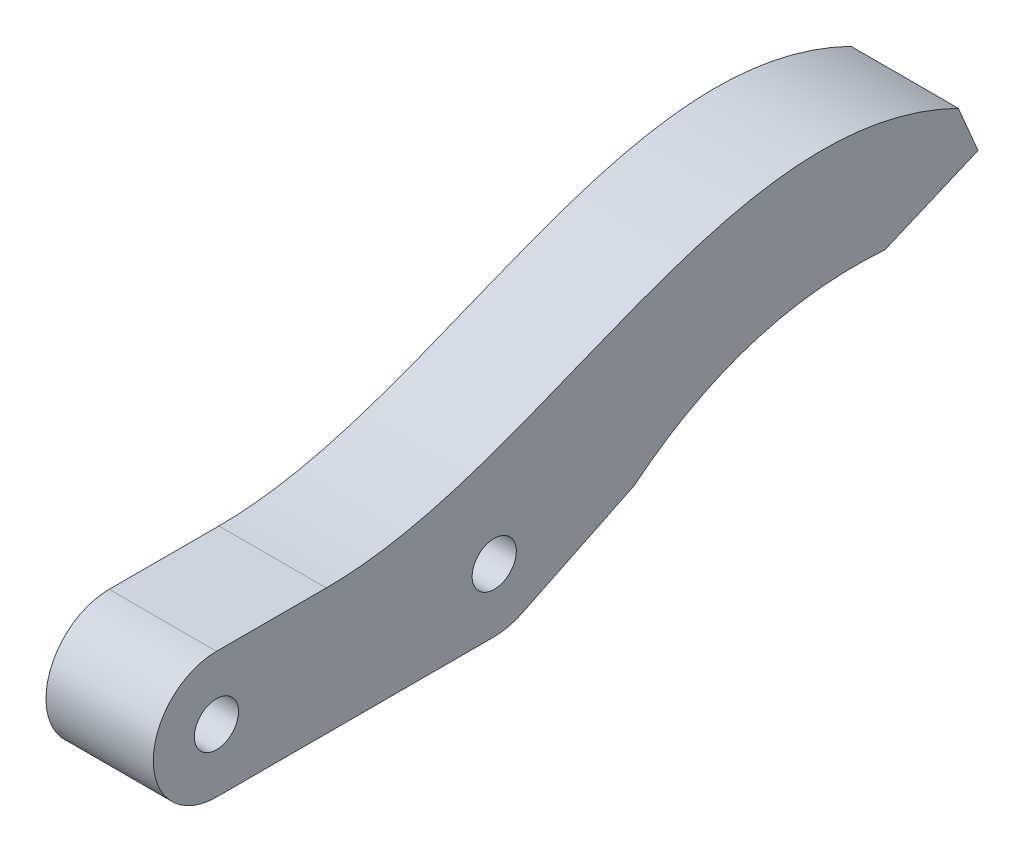
ISO-10303-21;
HEADER;
FILE_DESCRIPTION(('STEP AP214'),'2;1');
FILE_NAME('part.step','',(''),(''),'','','');
FILE_SCHEMA(('AUTOMOTIVE_DESIGN { 1 0 10303 214 1 1 1 1 }'));
ENDSEC;
DATA;
#1=APPLICATION_CONTEXT('core data for automotive mechanical design processes');
#2=APPLICATION_PROTOCOL_DEFINITION('international standard','automotive_design',2000,#1);
#3=PRODUCT_CONTEXT('',#1,'mechanical');
#4=PRODUCT('Part','Part','',(#3));
#5=PRODUCT_RELATED_PRODUCT_CATEGORY('part','',(#4));
#6=PRODUCT_DEFINITION_FORMATION('','',#4);
#7=PRODUCT_DEFINITION_CONTEXT('part definition',#1,'design');
#8=PRODUCT_DEFINITION('design','',#6,#7);
#9=PRODUCT_DEFINITION_SHAPE('','',#8);
#10=(LENGTH_UNIT() NAMED_UNIT(*) SI_UNIT(.MILLI.,.METRE.));
#11=(NAMED_UNIT(*) PLANE_ANGLE_UNIT() SI_UNIT($,.RADIAN.));
#12=(NAMED_UNIT(*) SI_UNIT($,.STERADIAN.) SOLID_ANGLE_UNIT());
#13=UNCERTAINTY_MEASURE_WITH_UNIT(LENGTH_MEASURE(1.E-05),#10,'distance_accuracy_value','');
#14=(GEOMETRIC_REPRESENTATION_CONTEXT(3) GLOBAL_UNCERTAINTY_ASSIGNED_CONTEXT((#13)) GLOBAL_UNIT_ASSIGNED_CONTEXT((#10,
#11,#12)) REPRESENTATION_CONTEXT('',''));
#15=CARTESIAN_POINT('',(0.,0.,0.));
#16=DIRECTION('',(0.,0.,1.));
#17=DIRECTION('',(1.,0.,0.));
#18=AXIS2_PLACEMENT_3D('',#15,#16,#17);
#19=CARTESIAN_POINT('',(8.5,5.,-27.));
#20=DIRECTION('',(-1.,0.,0.));
#21=DIRECTION('',(0.,0.,1.));
#22=AXIS2_PLACEMENT_3D('',#19,#20,#21);
#23=CYLINDRICAL_SURFACE('',#22,5.);
#24=DIRECTION('',(1.,0.,0.));
#25=VECTOR('',#24,1.);
#26=CARTESIAN_POINT('',(0.,0.502127655445501,-29.1838370754458));
#27=LINE('',#26,#25);
#28=CARTESIAN_POINT('',(0.,0.502127655445501,-29.1838370754458));
#29=VERTEX_POINT('',#28);
#30=CARTESIAN_POINT('',(8.5,0.502127655445501,-29.1838370754458));
#31=VERTEX_POINT('',#30);
#32=EDGE_CURVE('E191',#29,#31,#27,.T.);
#33=ORIENTED_EDGE('',*,*,#32,.T.);
#34=CARTESIAN_POINT('',(8.5,5.,-27.));
#35=DIRECTION('',(1.,0.,0.));
#36=DIRECTION('',(0.,0.,-1.));
#37=AXIS2_PLACEMENT_3D('',#34,#35,#36);
#38=CIRCLE('',#37,5.);
#39=CARTESIAN_POINT('',(8.5,0.,-27.));
#40=VERTEX_POINT('',#39);
#41=EDGE_CURVE('E203',#40,#31,#38,.T.);
#42=ORIENTED_EDGE('',*,*,#41,.F.);
#43=DIRECTION('',(-1.,0.,0.));
#44=VECTOR('',#43,1.);
#45=CARTESIAN_POINT('',(8.5,0.,-27.));
#46=LINE('',#45,#44);
#47=CARTESIAN_POINT('',(0.,0.,-27.));
#48=VERTEX_POINT('',#47);
#49=EDGE_CURVE('E211',#40,#48,#46,.T.);
#50=ORIENTED_EDGE('',*,*,#49,.T.);
#51=CARTESIAN_POINT('',(0.,5.,-27.));
#52=DIRECTION('',(1.,0.,0.));
#53=DIRECTION('',(0.,0.,-1.));
#54=AXIS2_PLACEMENT_3D('',#51,#52,#53);
#55=CIRCLE('',#54,5.);
#56=EDGE_CURVE('E215',#48,#29,#55,.T.);
#57=ORIENTED_EDGE('',*,*,#56,.T.);
#58=EDGE_LOOP('',(#33,#42,#50,#57));
#59=FACE_BOUND('',#58,.T.);
#60=ADVANCED_FACE('F36',(#59),#23,.T.);
#61=CARTESIAN_POINT('',(8.5,10.,0.));
#62=DIRECTION('',(0.,1.,0.));
#63=DIRECTION('',(0.,0.,1.));
#64=AXIS2_PLACEMENT_3D('',#61,#62,#63);
#65=PLANE('',#64);
#66=DIRECTION('',(1.,0.,0.));
#67=VECTOR('',#66,1.);
#68=CARTESIAN_POINT('',(0.,10.,-13.6949747586838));
#69=LINE('',#68,#67);
#70=CARTESIAN_POINT('',(0.,10.,-13.6949747586838));
#71=VERTEX_POINT('',#70);
#72=CARTESIAN_POINT('',(8.5,10.,-13.6949747586838));
#73=VERTEX_POINT('',#72);
#74=EDGE_CURVE('E126',#71,#73,#69,.T.);
#75=ORIENTED_EDGE('',*,*,#74,.F.);
#76=DIRECTION('',(0.,0.,-1.));
#77=VECTOR('',#76,1.);
#78=CARTESIAN_POINT('',(0.,10.,0.));
#79=LINE('',#78,#77);
#80=CARTESIAN_POINT('',(0.,10.,-5.));
#81=VERTEX_POINT('',#80);
#82=EDGE_CURVE('E137',#81,#71,#79,.T.);
#83=ORIENTED_EDGE('',*,*,#82,.F.);
#84=DIRECTION('',(-1.,0.,0.));
#85=VECTOR('',#84,1.);
#86=CARTESIAN_POINT('',(8.5,10.,-5.));
#87=LINE('',#86,#85);
#88=CARTESIAN_POINT('',(8.5,10.,-5.));
#89=VERTEX_POINT('',#88);
#90=EDGE_CURVE('E11',#89,#81,#87,.T.);
#91=ORIENTED_EDGE('',*,*,#90,.F.);
#92=DIRECTION('',(0.,0.,-1.));
#93=VECTOR('',#92,1.);
#94=CARTESIAN_POINT('',(8.5,10.,0.));
#95=LINE('',#94,#93);
#96=EDGE_CURVE('E190',#89,#73,#95,.T.);
#97=ORIENTED_EDGE('',*,*,#96,.T.);
#98=EDGE_LOOP('',(#75,#83,#91,#97));
#99=FACE_BOUND('',#98,.T.);
#100=ADVANCED_FACE('F38',(#99),#65,.T.);
#101=CARTESIAN_POINT('',(8.5,5.,-5.));
#102=DIRECTION('',(-1.,0.,0.));
#103=DIRECTION('',(0.,0.,1.));
#104=AXIS2_PLACEMENT_3D('',#101,#102,#103);
#105=CYLINDRICAL_SURFACE('',#104,5.);
#106=CARTESIAN_POINT('',(0.,5.,-5.));
#107=DIRECTION('',(1.,0.,0.));
#108=DIRECTION('',(0.,0.,-1.));
#109=AXIS2_PLACEMENT_3D('',#106,#107,#108);
#110=CIRCLE('',#109,5.);
#111=CARTESIAN_POINT('',(0.,0.,-5.));
#112=VERTEX_POINT('',#111);
#113=EDGE_CURVE('E66',#81,#112,#110,.T.);
#114=ORIENTED_EDGE('',*,*,#113,.T.);
#115=DIRECTION('',(-1.,0.,0.));
#116=VECTOR('',#115,1.);
#117=CARTESIAN_POINT('',(8.5,0.,-5.));
#118=LINE('',#117,#116);
#119=CARTESIAN_POINT('',(8.5,0.,-5.));
#120=VERTEX_POINT('',#119);
#121=EDGE_CURVE('E45',#120,#112,#118,.T.);
#122=ORIENTED_EDGE('',*,*,#121,.F.);
#123=CARTESIAN_POINT('',(8.5,5.,-5.));
#124=DIRECTION('',(1.,0.,0.));
#125=DIRECTION('',(0.,0.,-1.));
#126=AXIS2_PLACEMENT_3D('',#123,#124,#125);
#127=CIRCLE('',#126,5.);
#128=EDGE_CURVE('E199',#89,#120,#127,.T.);
#129=ORIENTED_EDGE('',*,*,#128,.F.);
#130=ORIENTED_EDGE('',*,*,#90,.T.);
#131=EDGE_LOOP('',(#114,#122,#129,#130));
#132=FACE_BOUND('',#131,.T.);
#133=ADVANCED_FACE('F182',(#132),#105,.T.);
#134=CARTESIAN_POINT('',(8.5,0.,0.));
#135=DIRECTION('',(0.,1.,0.));
#136=DIRECTION('',(0.,0.,1.));
#137=AXIS2_PLACEMENT_3D('',#134,#135,#136);
#138=PLANE('',#137);
#139=DIRECTION('',(0.,0.,-1.));
#140=VECTOR('',#139,1.);
#141=CARTESIAN_POINT('',(0.,0.,0.));
#142=LINE('',#141,#140);
#143=EDGE_CURVE('E71',#112,#48,#142,.T.);
#144=ORIENTED_EDGE('',*,*,#143,.T.);
#145=ORIENTED_EDGE('',*,*,#49,.F.);
#146=DIRECTION('',(0.,0.,-1.));
#147=VECTOR('',#146,1.);
#148=CARTESIAN_POINT('',(8.5,0.,0.));
#149=LINE('',#148,#147);
#150=EDGE_CURVE('E53',#120,#40,#149,.T.);
#151=ORIENTED_EDGE('',*,*,#150,.F.);
#152=ORIENTED_EDGE('',*,*,#121,.T.);
#153=EDGE_LOOP('',(#144,#145,#151,#152));
#154=FACE_BOUND('',#153,.T.);
#155=ADVANCED_FACE('F176',(#154),#138,.F.);
#156=CARTESIAN_POINT('',(8.5,5.,-5.));
#157=DIRECTION('',(-1.,0.,0.));
#158=DIRECTION('',(0.,0.,1.));
#159=AXIS2_PLACEMENT_3D('',#156,#157,#158);
#160=CYLINDRICAL_SURFACE('',#159,1.75);
#161=CARTESIAN_POINT('',(8.5,5.,-5.));
#162=DIRECTION('',(1.,0.,0.));
#163=DIRECTION('',(0.,0.,-1.));
#164=AXIS2_PLACEMENT_3D('',#161,#162,#163);
#165=CIRCLE('',#164,1.75);
#166=CARTESIAN_POINT('',(8.5,5.,-6.75));
#167=VERTEX_POINT('',#166);
#168=EDGE_CURVE('E205',#167,#167,#165,.T.);
#169=ORIENTED_EDGE('',*,*,#168,.T.);
#170=EDGE_LOOP('',(#169));
#171=FACE_BOUND('',#170,.T.);
#172=CARTESIAN_POINT('',(0.,5.,-5.));
#173=DIRECTION('',(1.,0.,0.));
#174=DIRECTION('',(0.,0.,-1.));
#175=AXIS2_PLACEMENT_3D('',#172,#173,#174);
#176=CIRCLE('',#175,1.75);
#177=CARTESIAN_POINT('',(0.,5.,-6.75));
#178=VERTEX_POINT('',#177);
#179=EDGE_CURVE('E218',#178,#178,#176,.T.);
#180=ORIENTED_EDGE('',*,*,#179,.F.);
#181=EDGE_LOOP('',(#180));
#182=FACE_BOUND('',#181,.T.);
#183=ADVANCED_FACE('F172',(#171,#182),#160,.F.);
#184=CARTESIAN_POINT('',(8.5,5.,-27.));
#185=DIRECTION('',(-1.,0.,0.));
#186=DIRECTION('',(0.,0.,1.));
#187=AXIS2_PLACEMENT_3D('',#184,#185,#186);
#188=CYLINDRICAL_SURFACE('',#187,1.75);
#189=CARTESIAN_POINT('',(8.5,5.,-27.));
#190=DIRECTION('',(1.,0.,0.));
#191=DIRECTION('',(0.,0.,-1.));
#192=AXIS2_PLACEMENT_3D('',#189,#190,#191);
#193=CIRCLE('',#192,1.75);
#194=CARTESIAN_POINT('',(8.5,5.,-28.75));
#195=VERTEX_POINT('',#194);
#196=EDGE_CURVE('E208',#195,#195,#193,.T.);
#197=ORIENTED_EDGE('',*,*,#196,.T.);
#198=EDGE_LOOP('',(#197));
#199=FACE_BOUND('',#198,.T.);
#200=CARTESIAN_POINT('',(0.,5.,-27.));
#201=DIRECTION('',(1.,0.,0.));
#202=DIRECTION('',(0.,0.,-1.));
#203=AXIS2_PLACEMENT_3D('',#200,#201,#202);
#204=CIRCLE('',#203,1.75);
#205=CARTESIAN_POINT('',(0.,5.,-28.75));
#206=VERTEX_POINT('',#205);
#207=EDGE_CURVE('E200',#206,#206,#204,.T.);
#208=ORIENTED_EDGE('',*,*,#207,.F.);
#209=EDGE_LOOP('',(#208));
#210=FACE_BOUND('',#209,.T.);
#211=ADVANCED_FACE('F167',(#199,#210),#188,.F.);
#212=CARTESIAN_POINT('',(8.5,0.,0.));
#213=DIRECTION('',(1.,0.,0.));
#214=DIRECTION('',(0.,0.,-1.));
#215=AXIS2_PLACEMENT_3D('',#212,#213,#214);
#216=PLANE('',#215);
#217=ORIENTED_EDGE('',*,*,#96,.F.);
#218=ORIENTED_EDGE('',*,*,#128,.T.);
#219=ORIENTED_EDGE('',*,*,#150,.T.);
#220=ORIENTED_EDGE('',*,*,#41,.T.);
#221=DIRECTION('',(0.,0.436767415089167,-0.8995744689109));
#222=VECTOR('',#221,1.);
#223=CARTESIAN_POINT('',(8.5,-11.0601312365663,-5.36998891997289));
#224=LINE('',#223,#222);
#225=CARTESIAN_POINT('',(8.5,4.82408407678908,-38.0854206599091));
#226=VERTEX_POINT('',#225);
#227=EDGE_CURVE('E231',#31,#226,#224,.T.);
#228=ORIENTED_EDGE('',*,*,#227,.T.);
#229=CARTESIAN_POINT('',(8.5,4.82408407678908,-38.0854206599091));
#230=CARTESIAN_POINT('',(8.5,11.8952224566425,-46.7975095094647));
#231=CARTESIAN_POINT('',(8.5,11.0678436667493,-57.9480004086976));
#232=B_SPLINE_CURVE_WITH_KNOTS('',2,(#229,#230,#231),.UNSPECIFIED.,.F.,.F.,(3,3),(0.,1.),.UNSPECIFIED.);
#233=CARTESIAN_POINT('',(8.5,11.0678436667493,-57.9480004086976));
#234=VERTEX_POINT('',#233);
#235=EDGE_CURVE('E145',#226,#234,#232,.T.);
#236=ORIENTED_EDGE('',*,*,#235,.T.);
#237=DIRECTION('',(0.,0.39020935118337,-0.920726160293631));
#238=VECTOR('',#237,1.);
#239=CARTESIAN_POINT('',(8.5,-11.4367064909869,-4.84694582599828));
#240=LINE('',#239,#238);
#241=CARTESIAN_POINT('',(8.5,14.1895184762162,-65.3138096910467));
#242=VERTEX_POINT('',#241);
#243=EDGE_CURVE('E142',#234,#242,#240,.T.);
#244=ORIENTED_EDGE('',*,*,#243,.T.);
#245=DIRECTION('',(0.,0.920726160293631,0.39020935118337));
#246=VECTOR('',#245,1.);
#247=CARTESIAN_POINT('',(8.5,25.6262249672031,-60.4668638650484));
#248=LINE('',#247,#246);
#249=CARTESIAN_POINT('',(8.5,17.8724231173908,-63.7529722863132));
#250=VERTEX_POINT('',#249);
#251=EDGE_CURVE('E237',#242,#250,#248,.T.);
#252=ORIENTED_EDGE('',*,*,#251,.T.);
#253=CARTESIAN_POINT('',(8.5,17.8724231173908,-63.7529722863132));
#254=CARTESIAN_POINT('',(8.5,26.563787962677,-45.9288826779558));
#255=CARTESIAN_POINT('',(8.5,10.,-31.059268620705));
#256=CARTESIAN_POINT('',(8.5,10.,-13.6949747586838));
#257=B_SPLINE_CURVE_WITH_KNOTS('',3,(#253,#254,#255,#256),.UNSPECIFIED.,.F.,.F.,(4,4),(0.,1.),.UNSPECIFIED.);
#258=EDGE_CURVE('E121',#250,#73,#257,.T.);
#259=ORIENTED_EDGE('',*,*,#258,.T.);
#260=EDGE_LOOP('',(#217,#218,#219,#220,#228,#236,#244,#252,#259));
#261=FACE_BOUND('',#260,.T.);
#262=ORIENTED_EDGE('',*,*,#168,.F.);
#263=EDGE_LOOP('',(#262));
#264=FACE_BOUND('',#263,.T.);
#265=ORIENTED_EDGE('',*,*,#196,.F.);
#266=EDGE_LOOP('',(#265));
#267=FACE_BOUND('',#266,.T.);
#268=ADVANCED_FACE('F164',(#261,#264,#267),#216,.T.);
#269=CARTESIAN_POINT('',(0.,0.,0.));
#270=DIRECTION('',(1.,0.,0.));
#271=DIRECTION('',(0.,0.,-1.));
#272=AXIS2_PLACEMENT_3D('',#269,#270,#271);
#273=PLANE('',#272);
#274=ORIENTED_EDGE('',*,*,#82,.T.);
#275=CARTESIAN_POINT('',(0.,17.8724231173908,-63.7529722863132));
#276=CARTESIAN_POINT('',(0.,26.563787962677,-45.9288826779558));
#277=CARTESIAN_POINT('',(0.,10.,-31.059268620705));
#278=CARTESIAN_POINT('',(0.,10.,-13.6949747586838));
#279=B_SPLINE_CURVE_WITH_KNOTS('',3,(#275,#276,#277,#278),.UNSPECIFIED.,.F.,.F.,(4,4),(0.,1.),.UNSPECIFIED.);
#280=CARTESIAN_POINT('',(0.,17.8724231173908,-63.7529722863132));
#281=VERTEX_POINT('',#280);
#282=EDGE_CURVE('E118',#281,#71,#279,.T.);
#283=ORIENTED_EDGE('',*,*,#282,.F.);
#284=DIRECTION('',(0.,0.920726160293631,0.39020935118337));
#285=VECTOR('',#284,1.);
#286=CARTESIAN_POINT('',(0.,25.6262249672031,-60.4668638650484));
#287=LINE('',#286,#285);
#288=CARTESIAN_POINT('',(0.,14.1895184762162,-65.3138096910467));
#289=VERTEX_POINT('',#288);
#290=EDGE_CURVE('E135',#289,#281,#287,.T.);
#291=ORIENTED_EDGE('',*,*,#290,.F.);
#292=DIRECTION('',(0.,0.39020935118337,-0.920726160293631));
#293=VECTOR('',#292,1.);
#294=CARTESIAN_POINT('',(0.,-11.4367064909869,-4.84694582599828));
#295=LINE('',#294,#293);
#296=CARTESIAN_POINT('',(0.,11.0678436667493,-57.9480004086976));
#297=VERTEX_POINT('',#296);
#298=EDGE_CURVE('E127',#297,#289,#295,.T.);
#299=ORIENTED_EDGE('',*,*,#298,.F.);
#300=CARTESIAN_POINT('',(0.,4.82408407678908,-38.0854206599091));
#301=CARTESIAN_POINT('',(0.,11.8952224566425,-46.7975095094647));
#302=CARTESIAN_POINT('',(0.,11.0678436667493,-57.9480004086976));
#303=B_SPLINE_CURVE_WITH_KNOTS('',2,(#300,#301,#302),.UNSPECIFIED.,.F.,.F.,(3,3),(0.,1.),.UNSPECIFIED.);
#304=CARTESIAN_POINT('',(0.,4.82408407678908,-38.0854206599091));
#305=VERTEX_POINT('',#304);
#306=EDGE_CURVE('E253',#305,#297,#303,.T.);
#307=ORIENTED_EDGE('',*,*,#306,.F.);
#308=DIRECTION('',(0.,0.436767415089167,-0.8995744689109));
#309=VECTOR('',#308,1.);
#310=CARTESIAN_POINT('',(0.,-11.0601312365663,-5.36998891997289));
#311=LINE('',#310,#309);
#312=EDGE_CURVE('E138',#29,#305,#311,.T.);
#313=ORIENTED_EDGE('',*,*,#312,.F.);
#314=ORIENTED_EDGE('',*,*,#56,.F.);
#315=ORIENTED_EDGE('',*,*,#143,.F.);
#316=ORIENTED_EDGE('',*,*,#113,.F.);
#317=EDGE_LOOP('',(#274,#283,#291,#299,#307,#313,#314,#315,#316));
#318=FACE_BOUND('',#317,.T.);
#319=ORIENTED_EDGE('',*,*,#179,.T.);
#320=EDGE_LOOP('',(#319));
#321=FACE_BOUND('',#320,.T.);
#322=ORIENTED_EDGE('',*,*,#207,.T.);
#323=EDGE_LOOP('',(#322));
#324=FACE_BOUND('',#323,.T.);
#325=ADVANCED_FACE('F132',(#318,#321,#324),#273,.F.);
#326=CARTESIAN_POINT('',(0.,25.6262249672031,-60.4668638650484));
#327=DIRECTION('',(0.,0.39020935118337,-0.920726160293631));
#328=DIRECTION('',(0.,0.920726160293631,0.39020935118337));
#329=AXIS2_PLACEMENT_3D('',#326,#327,#328);
#330=PLANE('',#329);
#331=ORIENTED_EDGE('',*,*,#251,.F.);
#332=DIRECTION('',(1.,0.,0.));
#333=VECTOR('',#332,1.);
#334=CARTESIAN_POINT('',(0.,14.1895184762162,-65.3138096910467));
#335=LINE('',#334,#333);
#336=EDGE_CURVE('E141',#289,#242,#335,.T.);
#337=ORIENTED_EDGE('',*,*,#336,.F.);
#338=ORIENTED_EDGE('',*,*,#290,.T.);
#339=DIRECTION('',(1.,0.,0.));
#340=VECTOR('',#339,1.);
#341=CARTESIAN_POINT('',(0.,17.8724231173908,-63.7529722863132));
#342=LINE('',#341,#340);
#343=EDGE_CURVE('E115',#281,#250,#342,.T.);
#344=ORIENTED_EDGE('',*,*,#343,.T.);
#345=EDGE_LOOP('',(#331,#337,#338,#344));
#346=FACE_BOUND('',#345,.T.);
#347=ADVANCED_FACE('F140',(#346),#330,.T.);
#348=CARTESIAN_POINT('',(0.,-11.4367064909869,-4.84694582599828));
#349=DIRECTION('',(0.,-0.920726160293631,-0.39020935118337));
#350=DIRECTION('',(0.,0.39020935118337,-0.920726160293631));
#351=AXIS2_PLACEMENT_3D('',#348,#349,#350);
#352=PLANE('',#351);
#353=ORIENTED_EDGE('',*,*,#243,.F.);
#354=DIRECTION('',(1.,0.,0.));
#355=VECTOR('',#354,1.);
#356=CARTESIAN_POINT('',(0.,11.0678436667493,-57.9480004086976));
#357=LINE('',#356,#355);
#358=EDGE_CURVE('E249',#297,#234,#357,.T.);
#359=ORIENTED_EDGE('',*,*,#358,.F.);
#360=ORIENTED_EDGE('',*,*,#298,.T.);
#361=ORIENTED_EDGE('',*,*,#336,.T.);
#362=EDGE_LOOP('',(#353,#359,#360,#361));
#363=FACE_BOUND('',#362,.T.);
#364=ADVANCED_FACE('F163',(#363),#352,.T.);
#365=DIRECTION('',(1.,0.,0.));
#366=VECTOR('',#365,1.);
#367=SURFACE_OF_LINEAR_EXTRUSION('',#303,#366);
#368=ORIENTED_EDGE('',*,*,#235,.F.);
#369=DIRECTION('',(1.,0.,0.));
#370=VECTOR('',#369,1.);
#371=CARTESIAN_POINT('',(0.,4.82408407678908,-38.0854206599091));
#372=LINE('',#371,#370);
#373=EDGE_CURVE('E194',#305,#226,#372,.T.);
#374=ORIENTED_EDGE('',*,*,#373,.F.);
#375=ORIENTED_EDGE('',*,*,#306,.T.);
#376=ORIENTED_EDGE('',*,*,#358,.T.);
#377=EDGE_LOOP('',(#368,#374,#375,#376));
#378=FACE_BOUND('',#377,.T.);
#379=ADVANCED_FACE('F252',(#378),#367,.T.);
#380=CARTESIAN_POINT('',(0.,-11.0601312365663,-5.36998891997289));
#381=DIRECTION('',(0.,-0.8995744689109,-0.436767415089167));
#382=DIRECTION('',(0.,0.436767415089167,-0.8995744689109));
#383=AXIS2_PLACEMENT_3D('',#380,#381,#382);
#384=PLANE('',#383);
#385=ORIENTED_EDGE('',*,*,#227,.F.);
#386=ORIENTED_EDGE('',*,*,#32,.F.);
#387=ORIENTED_EDGE('',*,*,#312,.T.);
#388=ORIENTED_EDGE('',*,*,#373,.T.);
#389=EDGE_LOOP('',(#385,#386,#387,#388));
#390=FACE_BOUND('',#389,.T.);
#391=ADVANCED_FACE('F159',(#390),#384,.T.);
#392=DIRECTION('',(1.,0.,0.));
#393=VECTOR('',#392,1.);
#394=SURFACE_OF_LINEAR_EXTRUSION('',#279,#393);
#395=ORIENTED_EDGE('',*,*,#258,.F.);
#396=ORIENTED_EDGE('',*,*,#343,.F.);
#397=ORIENTED_EDGE('',*,*,#282,.T.);
#398=ORIENTED_EDGE('',*,*,#74,.T.);
#399=EDGE_LOOP('',(#395,#396,#397,#398));
#400=FACE_BOUND('',#399,.T.);
#401=ADVANCED_FACE('F117',(#400),#394,.T.);
#402=CLOSED_SHELL('',(#60,#100,#133,#155,#183,#211,#268,#325,#347,#364,#379,#391,#401));
#403=MANIFOLD_SOLID_BREP('B2',#402);
#404=ADVANCED_BREP_SHAPE_REPRESENTATION('',(#18,#403),#14);
#405=SHAPE_DEFINITION_REPRESENTATION(#9,#404);
ENDSEC;
END-ISO-10303-21;
